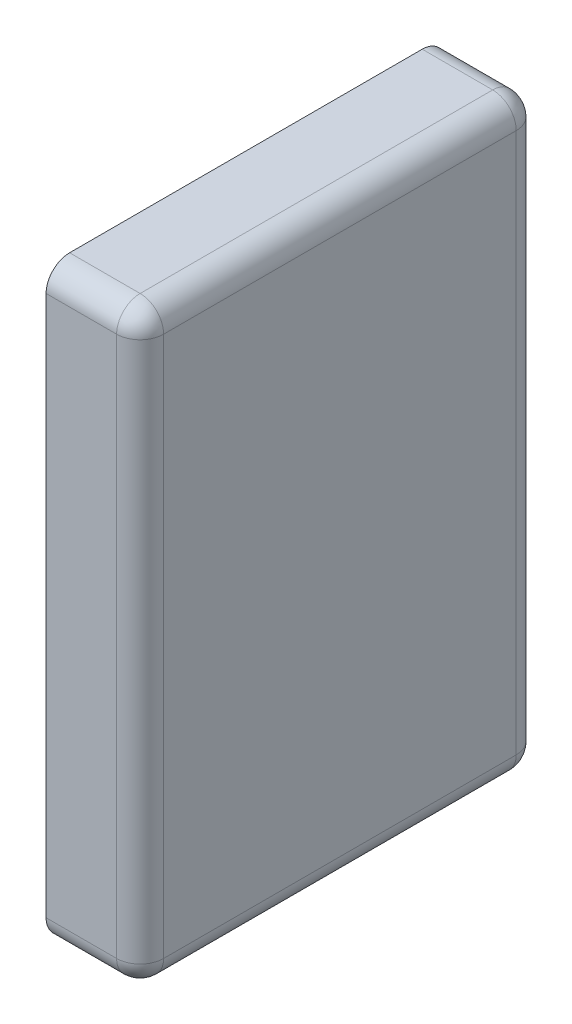
ISO-10303-21;
HEADER;
FILE_DESCRIPTION(('STEP AP214'),'2;1');
FILE_NAME('part.step','',(''),(''),'','','');
FILE_SCHEMA(('AUTOMOTIVE_DESIGN { 1 0 10303 214 1 1 1 1 }'));
ENDSEC;
DATA;
#1=APPLICATION_CONTEXT('core data for automotive mechanical design processes');
#2=APPLICATION_PROTOCOL_DEFINITION('international standard','automotive_design',2000,#1);
#3=PRODUCT_CONTEXT('',#1,'mechanical');
#4=PRODUCT('Part','Part','',(#3));
#5=PRODUCT_RELATED_PRODUCT_CATEGORY('part','',(#4));
#6=PRODUCT_DEFINITION_FORMATION('','',#4);
#7=PRODUCT_DEFINITION_CONTEXT('part definition',#1,'design');
#8=PRODUCT_DEFINITION('design','',#6,#7);
#9=PRODUCT_DEFINITION_SHAPE('','',#8);
#10=(LENGTH_UNIT() NAMED_UNIT(*) SI_UNIT(.MILLI.,.METRE.));
#11=(NAMED_UNIT(*) PLANE_ANGLE_UNIT() SI_UNIT($,.RADIAN.));
#12=(NAMED_UNIT(*) SI_UNIT($,.STERADIAN.) SOLID_ANGLE_UNIT());
#13=UNCERTAINTY_MEASURE_WITH_UNIT(LENGTH_MEASURE(1.E-05),#10,'distance_accuracy_value','');
#14=(GEOMETRIC_REPRESENTATION_CONTEXT(3) GLOBAL_UNCERTAINTY_ASSIGNED_CONTEXT((#13)) GLOBAL_UNIT_ASSIGNED_CONTEXT((#10,
#11,#12)) REPRESENTATION_CONTEXT('',''));
#15=CARTESIAN_POINT('',(0.,0.,0.));
#16=DIRECTION('',(0.,0.,1.));
#17=DIRECTION('',(1.,0.,0.));
#18=AXIS2_PLACEMENT_3D('',#15,#16,#17);
#19=CARTESIAN_POINT('',(0.95,-0.575,0.425));
#20=DIRECTION('',(0.,0.,-1.));
#21=DIRECTION('',(1.,0.,0.));
#22=AXIS2_PLACEMENT_3D('',#19,#20,#21);
#23=CYLINDRICAL_SURFACE('',#22,0.05);
#24=CARTESIAN_POINT('',(0.95,-0.575,0.05));
#25=DIRECTION('',(0.,0.,1.));
#26=DIRECTION('',(0.,1.,0.));
#27=AXIS2_PLACEMENT_3D('',#24,#25,#26);
#28=CIRCLE('',#27,0.05);
#29=CARTESIAN_POINT('',(0.95,-0.625,0.05));
#30=VERTEX_POINT('',#29);
#31=CARTESIAN_POINT('',(1.,-0.575,0.05));
#32=VERTEX_POINT('',#31);
#33=EDGE_CURVE('E11',#30,#32,#28,.T.);
#34=ORIENTED_EDGE('',*,*,#33,.T.);
#35=DIRECTION('',(0.,0.,-1.));
#36=VECTOR('',#35,1.);
#37=CARTESIAN_POINT('',(1.,-0.575,0.));
#38=LINE('',#37,#36);
#39=CARTESIAN_POINT('',(1.,-0.575,0.8));
#40=VERTEX_POINT('',#39);
#41=EDGE_CURVE('E150',#40,#32,#38,.T.);
#42=ORIENTED_EDGE('',*,*,#41,.F.);
#43=CARTESIAN_POINT('',(0.95,-0.575,0.8));
#44=DIRECTION('',(0.,0.,1.));
#45=DIRECTION('',(1.,0.,0.));
#46=AXIS2_PLACEMENT_3D('',#43,#44,#45);
#47=CIRCLE('',#46,0.05);
#48=CARTESIAN_POINT('',(0.95,-0.625,0.8));
#49=VERTEX_POINT('',#48);
#50=EDGE_CURVE('E112',#49,#40,#47,.T.);
#51=ORIENTED_EDGE('',*,*,#50,.F.);
#52=DIRECTION('',(0.,0.,1.));
#53=VECTOR('',#52,1.);
#54=CARTESIAN_POINT('',(0.95,-0.625,0.85));
#55=LINE('',#54,#53);
#56=EDGE_CURVE('E204',#30,#49,#55,.T.);
#57=ORIENTED_EDGE('',*,*,#56,.F.);
#58=EDGE_LOOP('',(#34,#42,#51,#57));
#59=FACE_BOUND('',#58,.T.);
#60=ADVANCED_FACE('F17',(#59),#23,.T.);
#61=CARTESIAN_POINT('',(0.95,0.575,0.05));
#62=DIRECTION('',(0.,0.,1.));
#63=DIRECTION('',(1.,0.,0.));
#64=AXIS2_PLACEMENT_3D('',#61,#62,#63);
#65=SPHERICAL_SURFACE('',#64,0.05);
#66=CARTESIAN_POINT('',(0.95,0.575,0.05));
#67=DIRECTION('',(0.,1.,0.));
#68=DIRECTION('',(0.,0.,1.));
#69=AXIS2_PLACEMENT_3D('',#66,#67,#68);
#70=CIRCLE('',#69,0.05);
#71=CARTESIAN_POINT('',(1.,0.575,0.05));
#72=VERTEX_POINT('',#71);
#73=CARTESIAN_POINT('',(0.95,0.575,0.));
#74=VERTEX_POINT('',#73);
#75=EDGE_CURVE('E176',#72,#74,#70,.T.);
#76=ORIENTED_EDGE('',*,*,#75,.T.);
#77=CARTESIAN_POINT('',(0.95,0.575,0.05));
#78=DIRECTION('',(1.,0.,0.));
#79=DIRECTION('',(0.,0.,-1.));
#80=AXIS2_PLACEMENT_3D('',#77,#78,#79);
#81=CIRCLE('',#80,0.05);
#82=CARTESIAN_POINT('',(0.95,0.625,0.05));
#83=VERTEX_POINT('',#82);
#84=EDGE_CURVE('E28',#74,#83,#81,.T.);
#85=ORIENTED_EDGE('',*,*,#84,.T.);
#86=CARTESIAN_POINT('',(0.95,0.575,0.05));
#87=DIRECTION('',(0.,0.,1.));
#88=DIRECTION('',(-1.,0.,0.));
#89=AXIS2_PLACEMENT_3D('',#86,#87,#88);
#90=CIRCLE('',#89,0.05);
#91=EDGE_CURVE('E180',#72,#83,#90,.T.);
#92=ORIENTED_EDGE('',*,*,#91,.F.);
#93=EDGE_LOOP('',(#76,#85,#92));
#94=FACE_BOUND('',#93,.T.);
#95=ADVANCED_FACE('F239',(#94),#65,.T.);
#96=CARTESIAN_POINT('',(0.95,-0.575,0.05));
#97=DIRECTION('',(0.,0.,1.));
#98=DIRECTION('',(1.,0.,0.));
#99=AXIS2_PLACEMENT_3D('',#96,#97,#98);
#100=SPHERICAL_SURFACE('',#99,0.05);
#101=CARTESIAN_POINT('',(0.95,-0.575,0.05));
#102=DIRECTION('',(1.,0.,0.));
#103=DIRECTION('',(0.,0.,-1.));
#104=AXIS2_PLACEMENT_3D('',#101,#102,#103);
#105=CIRCLE('',#104,0.05);
#106=CARTESIAN_POINT('',(0.95,-0.575,0.));
#107=VERTEX_POINT('',#106);
#108=EDGE_CURVE('E165',#30,#107,#105,.T.);
#109=ORIENTED_EDGE('',*,*,#108,.T.);
#110=CARTESIAN_POINT('',(0.95,-0.575,0.05));
#111=DIRECTION('',(0.,-1.,0.));
#112=DIRECTION('',(0.,0.,-1.));
#113=AXIS2_PLACEMENT_3D('',#110,#111,#112);
#114=CIRCLE('',#113,0.05);
#115=EDGE_CURVE('E194',#107,#32,#114,.T.);
#116=ORIENTED_EDGE('',*,*,#115,.T.);
#117=ORIENTED_EDGE('',*,*,#33,.F.);
#118=EDGE_LOOP('',(#109,#116,#117));
#119=FACE_BOUND('',#118,.T.);
#120=ADVANCED_FACE('F311',(#119),#100,.T.);
#121=CARTESIAN_POINT('',(0.5,0.575,0.05));
#122=DIRECTION('',(1.,0.,0.));
#123=DIRECTION('',(0.,0.,1.));
#124=AXIS2_PLACEMENT_3D('',#121,#122,#123);
#125=CYLINDRICAL_SURFACE('',#124,0.05);
#126=CARTESIAN_POINT('',(0.8,0.575,0.05));
#127=DIRECTION('',(-1.,0.,0.));
#128=DIRECTION('',(0.,0.,-1.));
#129=AXIS2_PLACEMENT_3D('',#126,#127,#128);
#130=CIRCLE('',#129,0.05);
#131=CARTESIAN_POINT('',(0.8,0.625,0.05));
#132=VERTEX_POINT('',#131);
#133=CARTESIAN_POINT('',(0.8,0.575,0.));
#134=VERTEX_POINT('',#133);
#135=EDGE_CURVE('E128',#132,#134,#130,.T.);
#136=ORIENTED_EDGE('',*,*,#135,.F.);
#137=DIRECTION('',(-1.,0.,0.));
#138=VECTOR('',#137,1.);
#139=CARTESIAN_POINT('',(0.5,0.625,0.05));
#140=LINE('',#139,#138);
#141=EDGE_CURVE('E250',#83,#132,#140,.T.);
#142=ORIENTED_EDGE('',*,*,#141,.F.);
#143=ORIENTED_EDGE('',*,*,#84,.F.);
#144=DIRECTION('',(1.,0.,0.));
#145=VECTOR('',#144,1.);
#146=CARTESIAN_POINT('',(0.9,0.575,0.));
#147=LINE('',#146,#145);
#148=EDGE_CURVE('E161',#134,#74,#147,.T.);
#149=ORIENTED_EDGE('',*,*,#148,.F.);
#150=EDGE_LOOP('',(#136,#142,#143,#149));
#151=FACE_BOUND('',#150,.T.);
#152=ADVANCED_FACE('F305',(#151),#125,.T.);
#153=CARTESIAN_POINT('',(0.9,-0.575,0.05));
#154=DIRECTION('',(-1.,0.,0.));
#155=DIRECTION('',(0.,0.,-1.));
#156=AXIS2_PLACEMENT_3D('',#153,#154,#155);
#157=CYLINDRICAL_SURFACE('',#156,0.05);
#158=CARTESIAN_POINT('',(0.8,-0.575,0.05));
#159=DIRECTION('',(-1.,0.,0.));
#160=DIRECTION('',(0.,0.,-1.));
#161=AXIS2_PLACEMENT_3D('',#158,#159,#160);
#162=CIRCLE('',#161,0.05);
#163=CARTESIAN_POINT('',(0.8,-0.575,0.));
#164=VERTEX_POINT('',#163);
#165=CARTESIAN_POINT('',(0.8,-0.625,0.05));
#166=VERTEX_POINT('',#165);
#167=EDGE_CURVE('E193',#164,#166,#162,.T.);
#168=ORIENTED_EDGE('',*,*,#167,.F.);
#169=DIRECTION('',(-1.,0.,0.));
#170=VECTOR('',#169,1.);
#171=CARTESIAN_POINT('',(0.8,-0.575,0.));
#172=LINE('',#171,#170);
#173=EDGE_CURVE('E158',#107,#164,#172,.T.);
#174=ORIENTED_EDGE('',*,*,#173,.F.);
#175=ORIENTED_EDGE('',*,*,#108,.F.);
#176=DIRECTION('',(1.,0.,0.));
#177=VECTOR('',#176,1.);
#178=CARTESIAN_POINT('',(1.,-0.625,0.05));
#179=LINE('',#178,#177);
#180=EDGE_CURVE('E175',#166,#30,#179,.T.);
#181=ORIENTED_EDGE('',*,*,#180,.F.);
#182=EDGE_LOOP('',(#168,#174,#175,#181));
#183=FACE_BOUND('',#182,.T.);
#184=ADVANCED_FACE('F310',(#183),#157,.T.);
#185=CARTESIAN_POINT('',(0.9,-0.625,0.));
#186=DIRECTION('',(0.,0.,1.));
#187=DIRECTION('',(1.,0.,0.));
#188=AXIS2_PLACEMENT_3D('',#185,#186,#187);
#189=PLANE('',#188);
#190=DIRECTION('',(0.,-1.,0.));
#191=VECTOR('',#190,1.);
#192=CARTESIAN_POINT('',(0.95,-0.625,0.));
#193=LINE('',#192,#191);
#194=EDGE_CURVE('E197',#74,#107,#193,.T.);
#195=ORIENTED_EDGE('',*,*,#194,.T.);
#196=ORIENTED_EDGE('',*,*,#173,.T.);
#197=DIRECTION('',(0.,1.,0.));
#198=VECTOR('',#197,1.);
#199=CARTESIAN_POINT('',(0.8,-0.625,0.));
#200=LINE('',#199,#198);
#201=EDGE_CURVE('E138',#164,#134,#200,.T.);
#202=ORIENTED_EDGE('',*,*,#201,.T.);
#203=ORIENTED_EDGE('',*,*,#148,.T.);
#204=EDGE_LOOP('',(#195,#196,#202,#203));
#205=FACE_BOUND('',#204,.T.);
#206=ADVANCED_FACE('F319',(#205),#189,.F.);
#207=CARTESIAN_POINT('',(1.,-0.625,0.425));
#208=DIRECTION('',(-1.,0.,0.));
#209=DIRECTION('',(0.,0.,1.));
#210=AXIS2_PLACEMENT_3D('',#207,#208,#209);
#211=PLANE('',#210);
#212=DIRECTION('',(0.,-1.,0.));
#213=VECTOR('',#212,1.);
#214=CARTESIAN_POINT('',(1.,-0.625,0.8));
#215=LINE('',#214,#213);
#216=CARTESIAN_POINT('',(1.,0.575,0.8));
#217=VERTEX_POINT('',#216);
#218=EDGE_CURVE('E21',#217,#40,#215,.T.);
#219=ORIENTED_EDGE('',*,*,#218,.T.);
#220=ORIENTED_EDGE('',*,*,#41,.T.);
#221=DIRECTION('',(0.,1.,0.));
#222=VECTOR('',#221,1.);
#223=CARTESIAN_POINT('',(1.,-0.625,0.05));
#224=LINE('',#223,#222);
#225=EDGE_CURVE('E171',#32,#72,#224,.T.);
#226=ORIENTED_EDGE('',*,*,#225,.T.);
#227=DIRECTION('',(0.,0.,1.));
#228=VECTOR('',#227,1.);
#229=CARTESIAN_POINT('',(1.,0.575,0.425));
#230=LINE('',#229,#228);
#231=EDGE_CURVE('E156',#72,#217,#230,.T.);
#232=ORIENTED_EDGE('',*,*,#231,.T.);
#233=EDGE_LOOP('',(#219,#220,#226,#232));
#234=FACE_BOUND('',#233,.T.);
#235=ADVANCED_FACE('F223',(#234),#211,.F.);
#236=CARTESIAN_POINT('',(0.5,0.625,0.425));
#237=DIRECTION('',(0.,-1.,0.));
#238=DIRECTION('',(0.,0.,-1.));
#239=AXIS2_PLACEMENT_3D('',#236,#237,#238);
#240=PLANE('',#239);
#241=DIRECTION('',(0.,0.,-1.));
#242=VECTOR('',#241,1.);
#243=CARTESIAN_POINT('',(0.95,0.625,0.425));
#244=LINE('',#243,#242);
#245=CARTESIAN_POINT('',(0.95,0.625,0.8));
#246=VERTEX_POINT('',#245);
#247=EDGE_CURVE('E157',#246,#83,#244,.T.);
#248=ORIENTED_EDGE('',*,*,#247,.T.);
#249=ORIENTED_EDGE('',*,*,#141,.T.);
#250=DIRECTION('',(0.,0.,1.));
#251=VECTOR('',#250,1.);
#252=CARTESIAN_POINT('',(0.8,0.625,0.649600008));
#253=LINE('',#252,#251);
#254=CARTESIAN_POINT('',(0.8,0.625,0.8));
#255=VERTEX_POINT('',#254);
#256=EDGE_CURVE('E198',#132,#255,#253,.T.);
#257=ORIENTED_EDGE('',*,*,#256,.T.);
#258=DIRECTION('',(1.,0.,0.));
#259=VECTOR('',#258,1.);
#260=CARTESIAN_POINT('',(0.5,0.625,0.8));
#261=LINE('',#260,#259);
#262=EDGE_CURVE('E184',#255,#246,#261,.T.);
#263=ORIENTED_EDGE('',*,*,#262,.T.);
#264=EDGE_LOOP('',(#248,#249,#257,#263));
#265=FACE_BOUND('',#264,.T.);
#266=ADVANCED_FACE('F298',(#265),#240,.F.);
#267=CARTESIAN_POINT('',(0.5,-0.625,0.425));
#268=DIRECTION('',(0.,-1.,0.));
#269=DIRECTION('',(0.,0.,-1.));
#270=AXIS2_PLACEMENT_3D('',#267,#268,#269);
#271=PLANE('',#270);
#272=DIRECTION('',(0.,0.,1.));
#273=VECTOR('',#272,1.);
#274=CARTESIAN_POINT('',(0.8,-0.625,0.649600008));
#275=LINE('',#274,#273);
#276=CARTESIAN_POINT('',(0.8,-0.625,0.8));
#277=VERTEX_POINT('',#276);
#278=EDGE_CURVE('E189',#166,#277,#275,.T.);
#279=ORIENTED_EDGE('',*,*,#278,.F.);
#280=ORIENTED_EDGE('',*,*,#180,.T.);
#281=ORIENTED_EDGE('',*,*,#56,.T.);
#282=DIRECTION('',(-1.,0.,0.));
#283=VECTOR('',#282,1.);
#284=CARTESIAN_POINT('',(0.8,-0.625,0.8));
#285=LINE('',#284,#283);
#286=EDGE_CURVE('E141',#49,#277,#285,.T.);
#287=ORIENTED_EDGE('',*,*,#286,.T.);
#288=EDGE_LOOP('',(#279,#280,#281,#287));
#289=FACE_BOUND('',#288,.T.);
#290=ADVANCED_FACE('F276',(#289),#271,.T.);
#291=CARTESIAN_POINT('',(0.95,-0.625,0.05));
#292=DIRECTION('',(0.,-1.,0.));
#293=DIRECTION('',(0.,0.,1.));
#294=AXIS2_PLACEMENT_3D('',#291,#292,#293);
#295=CYLINDRICAL_SURFACE('',#294,0.05);
#296=ORIENTED_EDGE('',*,*,#115,.F.);
#297=ORIENTED_EDGE('',*,*,#194,.F.);
#298=ORIENTED_EDGE('',*,*,#75,.F.);
#299=ORIENTED_EDGE('',*,*,#225,.F.);
#300=EDGE_LOOP('',(#296,#297,#298,#299));
#301=FACE_BOUND('',#300,.T.);
#302=ADVANCED_FACE('F230',(#301),#295,.T.);
#303=CARTESIAN_POINT('',(0.95,-0.575,0.8));
#304=DIRECTION('',(0.,0.,1.));
#305=DIRECTION('',(1.,0.,0.));
#306=AXIS2_PLACEMENT_3D('',#303,#304,#305);
#307=SPHERICAL_SURFACE('',#306,0.05);
#308=CARTESIAN_POINT('',(0.95,-0.575,0.8));
#309=DIRECTION('',(1.,0.,0.));
#310=DIRECTION('',(0.,0.,-1.));
#311=AXIS2_PLACEMENT_3D('',#308,#309,#310);
#312=CIRCLE('',#311,0.05);
#313=CARTESIAN_POINT('',(0.95,-0.575,0.85));
#314=VERTEX_POINT('',#313);
#315=EDGE_CURVE('E109',#314,#49,#312,.T.);
#316=ORIENTED_EDGE('',*,*,#315,.T.);
#317=ORIENTED_EDGE('',*,*,#50,.T.);
#318=CARTESIAN_POINT('',(0.95,-0.575,0.8));
#319=DIRECTION('',(0.,1.,0.));
#320=DIRECTION('',(0.,0.,-1.));
#321=AXIS2_PLACEMENT_3D('',#318,#319,#320);
#322=CIRCLE('',#321,0.05);
#323=EDGE_CURVE('E105',#314,#40,#322,.T.);
#324=ORIENTED_EDGE('',*,*,#323,.F.);
#325=EDGE_LOOP('',(#316,#317,#324));
#326=FACE_BOUND('',#325,.T.);
#327=ADVANCED_FACE('F107',(#326),#307,.T.);
#328=CARTESIAN_POINT('',(0.95,0.575,0.8));
#329=DIRECTION('',(0.,0.,1.));
#330=DIRECTION('',(1.,0.,0.));
#331=AXIS2_PLACEMENT_3D('',#328,#329,#330);
#332=SPHERICAL_SURFACE('',#331,0.05);
#333=CARTESIAN_POINT('',(0.95,0.575,0.8));
#334=DIRECTION('',(0.,0.,1.));
#335=DIRECTION('',(1.,0.,0.));
#336=AXIS2_PLACEMENT_3D('',#333,#334,#335);
#337=CIRCLE('',#336,0.05);
#338=EDGE_CURVE('E153',#217,#246,#337,.T.);
#339=ORIENTED_EDGE('',*,*,#338,.T.);
#340=CARTESIAN_POINT('',(0.95,0.575,0.8));
#341=DIRECTION('',(1.,0.,0.));
#342=DIRECTION('',(0.,0.,-1.));
#343=AXIS2_PLACEMENT_3D('',#340,#341,#342);
#344=CIRCLE('',#343,0.05);
#345=CARTESIAN_POINT('',(0.95,0.575,0.85));
#346=VERTEX_POINT('',#345);
#347=EDGE_CURVE('E188',#246,#346,#344,.T.);
#348=ORIENTED_EDGE('',*,*,#347,.T.);
#349=CARTESIAN_POINT('',(0.95,0.575,0.8));
#350=DIRECTION('',(0.,-1.,0.));
#351=DIRECTION('',(0.,0.,1.));
#352=AXIS2_PLACEMENT_3D('',#349,#350,#351);
#353=CIRCLE('',#352,0.05);
#354=EDGE_CURVE('E123',#217,#346,#353,.T.);
#355=ORIENTED_EDGE('',*,*,#354,.F.);
#356=EDGE_LOOP('',(#339,#348,#355));
#357=FACE_BOUND('',#356,.T.);
#358=ADVANCED_FACE('F351',(#357),#332,.T.);
#359=CARTESIAN_POINT('',(0.95,-0.625,0.8));
#360=DIRECTION('',(0.,-1.,0.));
#361=DIRECTION('',(0.,0.,1.));
#362=AXIS2_PLACEMENT_3D('',#359,#360,#361);
#363=CYLINDRICAL_SURFACE('',#362,0.05);
#364=ORIENTED_EDGE('',*,*,#323,.T.);
#365=ORIENTED_EDGE('',*,*,#218,.F.);
#366=ORIENTED_EDGE('',*,*,#354,.T.);
#367=DIRECTION('',(0.,1.,0.));
#368=VECTOR('',#367,1.);
#369=CARTESIAN_POINT('',(0.95,-0.625,0.85));
#370=LINE('',#369,#368);
#371=EDGE_CURVE('E117',#314,#346,#370,.T.);
#372=ORIENTED_EDGE('',*,*,#371,.F.);
#373=EDGE_LOOP('',(#364,#365,#366,#372));
#374=FACE_BOUND('',#373,.T.);
#375=ADVANCED_FACE('F122',(#374),#363,.T.);
#376=CARTESIAN_POINT('',(0.9,-0.625,0.85));
#377=DIRECTION('',(0.,0.,-1.));
#378=DIRECTION('',(0.,-1.,0.));
#379=AXIS2_PLACEMENT_3D('',#376,#377,#378);
#380=PLANE('',#379);
#381=DIRECTION('',(0.,1.,0.));
#382=VECTOR('',#381,1.);
#383=CARTESIAN_POINT('',(0.8,-0.625,0.85));
#384=LINE('',#383,#382);
#385=CARTESIAN_POINT('',(0.8,-0.575,0.85));
#386=VERTEX_POINT('',#385);
#387=CARTESIAN_POINT('',(0.8,0.575,0.85));
#388=VERTEX_POINT('',#387);
#389=EDGE_CURVE('E133',#386,#388,#384,.T.);
#390=ORIENTED_EDGE('',*,*,#389,.F.);
#391=DIRECTION('',(1.,0.,0.));
#392=VECTOR('',#391,1.);
#393=CARTESIAN_POINT('',(1.,-0.575,0.85));
#394=LINE('',#393,#392);
#395=EDGE_CURVE('E131',#386,#314,#394,.T.);
#396=ORIENTED_EDGE('',*,*,#395,.T.);
#397=ORIENTED_EDGE('',*,*,#371,.T.);
#398=DIRECTION('',(-1.,0.,0.));
#399=VECTOR('',#398,1.);
#400=CARTESIAN_POINT('',(0.9,0.575,0.85));
#401=LINE('',#400,#399);
#402=EDGE_CURVE('E170',#346,#388,#401,.T.);
#403=ORIENTED_EDGE('',*,*,#402,.T.);
#404=EDGE_LOOP('',(#390,#396,#397,#403));
#405=FACE_BOUND('',#404,.T.);
#406=ADVANCED_FACE('F132',(#405),#380,.F.);
#407=CARTESIAN_POINT('',(0.8,-0.625,0.649600008));
#408=DIRECTION('',(1.,0.,0.));
#409=DIRECTION('',(0.,1.,0.));
#410=AXIS2_PLACEMENT_3D('',#407,#408,#409);
#411=PLANE('',#410);
#412=ORIENTED_EDGE('',*,*,#201,.F.);
#413=ORIENTED_EDGE('',*,*,#167,.T.);
#414=ORIENTED_EDGE('',*,*,#278,.T.);
#415=CARTESIAN_POINT('',(0.8,-0.575,0.8));
#416=DIRECTION('',(-1.,0.,0.));
#417=DIRECTION('',(0.,0.,-1.));
#418=AXIS2_PLACEMENT_3D('',#415,#416,#417);
#419=CIRCLE('',#418,0.05);
#420=EDGE_CURVE('E147',#277,#386,#419,.T.);
#421=ORIENTED_EDGE('',*,*,#420,.T.);
#422=ORIENTED_EDGE('',*,*,#389,.T.);
#423=CARTESIAN_POINT('',(0.8,0.575,0.8));
#424=DIRECTION('',(-1.,0.,0.));
#425=DIRECTION('',(0.,0.,-1.));
#426=AXIS2_PLACEMENT_3D('',#423,#424,#425);
#427=CIRCLE('',#426,0.05);
#428=EDGE_CURVE('E166',#388,#255,#427,.T.);
#429=ORIENTED_EDGE('',*,*,#428,.T.);
#430=ORIENTED_EDGE('',*,*,#256,.F.);
#431=ORIENTED_EDGE('',*,*,#135,.T.);
#432=EDGE_LOOP('',(#412,#413,#414,#421,#422,#429,#430,#431));
#433=FACE_BOUND('',#432,.T.);
#434=ADVANCED_FACE('F209',(#433),#411,.F.);
#435=CARTESIAN_POINT('',(0.9,-0.575,0.8));
#436=DIRECTION('',(1.,0.,0.));
#437=DIRECTION('',(0.,0.,1.));
#438=AXIS2_PLACEMENT_3D('',#435,#436,#437);
#439=CYLINDRICAL_SURFACE('',#438,0.05);
#440=ORIENTED_EDGE('',*,*,#420,.F.);
#441=ORIENTED_EDGE('',*,*,#286,.F.);
#442=ORIENTED_EDGE('',*,*,#315,.F.);
#443=ORIENTED_EDGE('',*,*,#395,.F.);
#444=EDGE_LOOP('',(#440,#441,#442,#443));
#445=FACE_BOUND('',#444,.T.);
#446=ADVANCED_FACE('F19',(#445),#439,.T.);
#447=CARTESIAN_POINT('',(0.95,0.575,0.425));
#448=DIRECTION('',(0.,0.,1.));
#449=DIRECTION('',(-1.,0.,0.));
#450=AXIS2_PLACEMENT_3D('',#447,#448,#449);
#451=CYLINDRICAL_SURFACE('',#450,0.05);
#452=ORIENTED_EDGE('',*,*,#91,.T.);
#453=ORIENTED_EDGE('',*,*,#247,.F.);
#454=ORIENTED_EDGE('',*,*,#338,.F.);
#455=ORIENTED_EDGE('',*,*,#231,.F.);
#456=EDGE_LOOP('',(#452,#453,#454,#455));
#457=FACE_BOUND('',#456,.T.);
#458=ADVANCED_FACE('F237',(#457),#451,.T.);
#459=CARTESIAN_POINT('',(0.5,0.575,0.8));
#460=DIRECTION('',(-1.,0.,0.));
#461=DIRECTION('',(0.,0.,-1.));
#462=AXIS2_PLACEMENT_3D('',#459,#460,#461);
#463=CYLINDRICAL_SURFACE('',#462,0.05);
#464=ORIENTED_EDGE('',*,*,#428,.F.);
#465=ORIENTED_EDGE('',*,*,#402,.F.);
#466=ORIENTED_EDGE('',*,*,#347,.F.);
#467=ORIENTED_EDGE('',*,*,#262,.F.);
#468=EDGE_LOOP('',(#464,#465,#466,#467));
#469=FACE_BOUND('',#468,.T.);
#470=ADVANCED_FACE('F284',(#469),#463,.T.);
#471=CLOSED_SHELL('',(#60,#95,#120,#152,#184,#206,#235,#266,#290,#302,#327,#358,#375,#406,#434,
#446,#458,#470));
#472=MANIFOLD_SOLID_BREP('B1',#471);
#473=ADVANCED_BREP_SHAPE_REPRESENTATION('',(#18,#472),#14);
#474=SHAPE_DEFINITION_REPRESENTATION(#9,#473);
ENDSEC;
END-ISO-10303-21;
